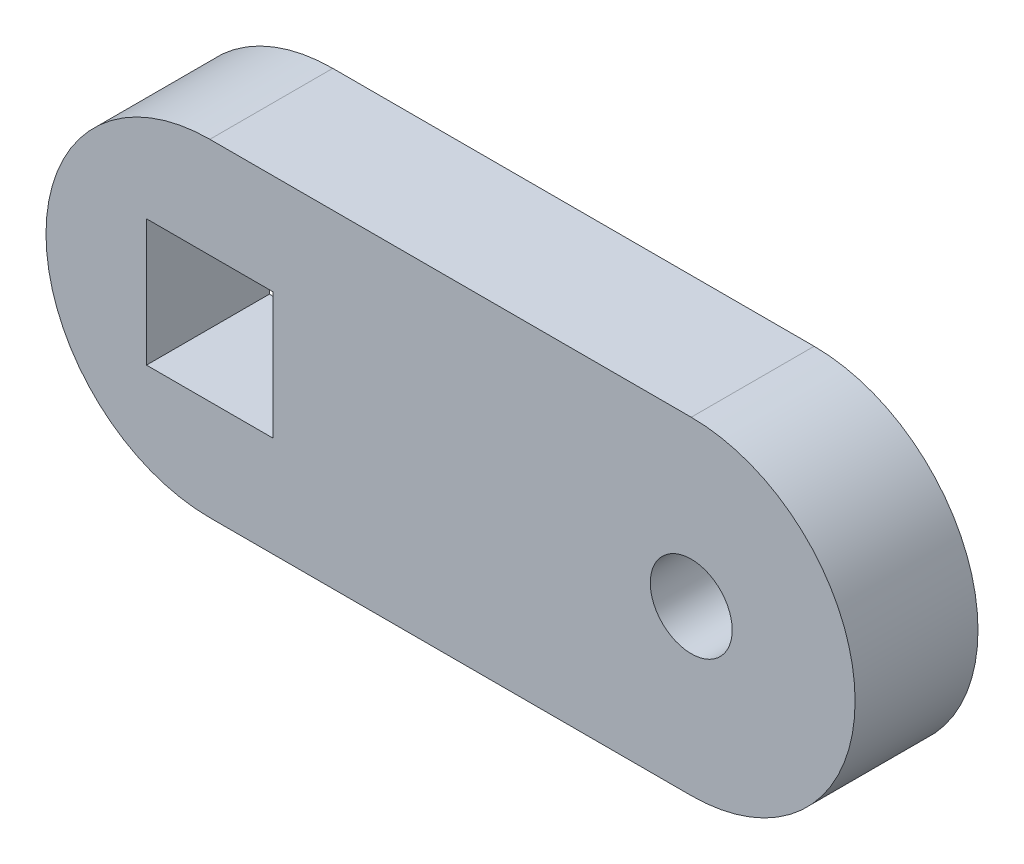
ISO-10303-21;
HEADER;
FILE_DESCRIPTION(('STEP AP214'),'2;1');
FILE_NAME('part.step','',(''),(''),'','','');
FILE_SCHEMA(('AUTOMOTIVE_DESIGN { 1 0 10303 214 1 1 1 1 }'));
ENDSEC;
DATA;
#1=APPLICATION_CONTEXT('core data for automotive mechanical design processes');
#2=APPLICATION_PROTOCOL_DEFINITION('international standard','automotive_design',2000,#1);
#3=PRODUCT_CONTEXT('',#1,'mechanical');
#4=PRODUCT('Part','Part','',(#3));
#5=PRODUCT_RELATED_PRODUCT_CATEGORY('part','',(#4));
#6=PRODUCT_DEFINITION_FORMATION('','',#4);
#7=PRODUCT_DEFINITION_CONTEXT('part definition',#1,'design');
#8=PRODUCT_DEFINITION('design','',#6,#7);
#9=PRODUCT_DEFINITION_SHAPE('','',#8);
#10=(LENGTH_UNIT() NAMED_UNIT(*) SI_UNIT(.MILLI.,.METRE.));
#11=(NAMED_UNIT(*) PLANE_ANGLE_UNIT() SI_UNIT($,.RADIAN.));
#12=(NAMED_UNIT(*) SI_UNIT($,.STERADIAN.) SOLID_ANGLE_UNIT());
#13=UNCERTAINTY_MEASURE_WITH_UNIT(LENGTH_MEASURE(1.E-05),#10,'distance_accuracy_value','');
#14=(GEOMETRIC_REPRESENTATION_CONTEXT(3) GLOBAL_UNCERTAINTY_ASSIGNED_CONTEXT((#13)) GLOBAL_UNIT_ASSIGNED_CONTEXT((#10,
#11,#12)) REPRESENTATION_CONTEXT('',''));
#15=CARTESIAN_POINT('',(0.,0.,0.));
#16=DIRECTION('',(0.,0.,1.));
#17=DIRECTION('',(1.,0.,0.));
#18=AXIS2_PLACEMENT_3D('',#15,#16,#17);
#19=CARTESIAN_POINT('',(50.0261953364315,13.7685928373175,6.));
#20=DIRECTION('',(0.,0.,1.));
#21=DIRECTION('',(1.,0.,0.));
#22=AXIS2_PLACEMENT_3D('',#19,#20,#21);
#23=PLANE('',#22);
#24=DIRECTION('',(0.,1.,0.));
#25=VECTOR('',#24,1.);
#26=CARTESIAN_POINT('',(29.6199453364315,10.6748428373166,6.));
#27=LINE('',#26,#25);
#28=CARTESIAN_POINT('',(29.6199453364315,10.6748428373166,6.));
#29=VERTEX_POINT('',#28);
#30=CARTESIAN_POINT('',(29.6199453364315,16.8623428373166,6.));
#31=VERTEX_POINT('',#30);
#32=EDGE_CURVE('E157',#29,#31,#27,.T.);
#33=ORIENTED_EDGE('',*,*,#32,.F.);
#34=DIRECTION('',(1.,0.,0.));
#35=VECTOR('',#34,1.);
#36=CARTESIAN_POINT('',(23.4324453364315,10.6748428373166,6.));
#37=LINE('',#36,#35);
#38=CARTESIAN_POINT('',(23.4324453364315,10.6748428373166,6.));
#39=VERTEX_POINT('',#38);
#40=EDGE_CURVE('E148',#39,#29,#37,.T.);
#41=ORIENTED_EDGE('',*,*,#40,.F.);
#42=DIRECTION('',(0.,-1.,0.));
#43=VECTOR('',#42,1.);
#44=CARTESIAN_POINT('',(23.4324453364315,16.8623428373166,6.));
#45=LINE('',#44,#43);
#46=CARTESIAN_POINT('',(23.4324453364315,16.8623428373166,6.));
#47=VERTEX_POINT('',#46);
#48=EDGE_CURVE('E175',#47,#39,#45,.T.);
#49=ORIENTED_EDGE('',*,*,#48,.F.);
#50=DIRECTION('',(-1.,0.,0.));
#51=VECTOR('',#50,1.);
#52=CARTESIAN_POINT('',(29.6199453364315,16.8623428373166,6.));
#53=LINE('',#52,#51);
#54=EDGE_CURVE('E171',#31,#47,#53,.T.);
#55=ORIENTED_EDGE('',*,*,#54,.F.);
#56=EDGE_LOOP('',(#33,#41,#49,#55));
#57=FACE_BOUND('',#56,.T.);
#58=DIRECTION('',(1.,0.,0.));
#59=VECTOR('',#58,1.);
#60=CARTESIAN_POINT('',(26.5261953364315,21.7685928373175,6.));
#61=LINE('',#60,#59);
#62=CARTESIAN_POINT('',(26.5261953364315,21.7685928373175,6.));
#63=VERTEX_POINT('',#62);
#64=CARTESIAN_POINT('',(50.0261953364315,21.7685928373175,6.));
#65=VERTEX_POINT('',#64);
#66=EDGE_CURVE('E199',#63,#65,#61,.T.);
#67=ORIENTED_EDGE('',*,*,#66,.F.);
#68=CARTESIAN_POINT('',(26.5261953364287,13.7685928373178,6.));
#69=DIRECTION('',(0.,0.,1.));
#70=DIRECTION('',(1.,0.,0.));
#71=AXIS2_PLACEMENT_3D('',#68,#69,#70);
#72=CIRCLE('',#71,7.99999999999977);
#73=CARTESIAN_POINT('',(26.526195336426,5.76859283731799,6.));
#74=VERTEX_POINT('',#73);
#75=EDGE_CURVE('E210',#63,#74,#72,.T.);
#76=ORIENTED_EDGE('',*,*,#75,.T.);
#77=DIRECTION('',(1.,0.,0.));
#78=VECTOR('',#77,1.);
#79=CARTESIAN_POINT('',(26.526195336426,5.76859283731799,6.));
#80=LINE('',#79,#78);
#81=CARTESIAN_POINT('',(50.0261953364387,5.76859283731753,6.));
#82=VERTEX_POINT('',#81);
#83=EDGE_CURVE('E207',#74,#82,#80,.T.);
#84=ORIENTED_EDGE('',*,*,#83,.T.);
#85=CARTESIAN_POINT('',(50.0261953364315,13.7685928373175,6.));
#86=DIRECTION('',(0.,0.,1.));
#87=DIRECTION('',(1.,0.,0.));
#88=AXIS2_PLACEMENT_3D('',#85,#86,#87);
#89=CIRCLE('',#88,8.);
#90=EDGE_CURVE('E203',#82,#65,#89,.T.);
#91=ORIENTED_EDGE('',*,*,#90,.T.);
#92=EDGE_LOOP('',(#67,#76,#84,#91));
#93=FACE_BOUND('',#92,.T.);
#94=CARTESIAN_POINT('',(50.0261953364315,13.7685928373175,6.));
#95=DIRECTION('',(0.,0.,1.));
#96=DIRECTION('',(1.,0.,0.));
#97=AXIS2_PLACEMENT_3D('',#94,#95,#96);
#98=CIRCLE('',#97,2.);
#99=CARTESIAN_POINT('',(52.0261953364315,13.7685928373175,6.));
#100=VERTEX_POINT('',#99);
#101=EDGE_CURVE('E183',#100,#100,#98,.T.);
#102=ORIENTED_EDGE('',*,*,#101,.F.);
#103=EDGE_LOOP('',(#102));
#104=FACE_BOUND('',#103,.T.);
#105=ADVANCED_FACE('F81',(#57,#93,#104),#23,.T.);
#106=CARTESIAN_POINT('',(50.0261953364315,13.7685928373175,0.));
#107=DIRECTION('',(0.,0.,1.));
#108=DIRECTION('',(1.,0.,0.));
#109=AXIS2_PLACEMENT_3D('',#106,#107,#108);
#110=PLANE('',#109);
#111=DIRECTION('',(1.,0.,0.));
#112=VECTOR('',#111,1.);
#113=CARTESIAN_POINT('',(26.5261953364315,21.7685928373175,0.));
#114=LINE('',#113,#112);
#115=CARTESIAN_POINT('',(26.5261953364315,21.7685928373175,0.));
#116=VERTEX_POINT('',#115);
#117=CARTESIAN_POINT('',(50.0261953364315,21.7685928373175,0.));
#118=VERTEX_POINT('',#117);
#119=EDGE_CURVE('E166',#116,#118,#114,.T.);
#120=ORIENTED_EDGE('',*,*,#119,.T.);
#121=CARTESIAN_POINT('',(50.0261953364315,13.7685928373175,0.));
#122=DIRECTION('',(0.,0.,1.));
#123=DIRECTION('',(1.,0.,0.));
#124=AXIS2_PLACEMENT_3D('',#121,#122,#123);
#125=CIRCLE('',#124,8.);
#126=CARTESIAN_POINT('',(50.0261953364387,5.76859283731753,0.));
#127=VERTEX_POINT('',#126);
#128=EDGE_CURVE('E216',#127,#118,#125,.T.);
#129=ORIENTED_EDGE('',*,*,#128,.F.);
#130=DIRECTION('',(1.,0.,0.));
#131=VECTOR('',#130,1.);
#132=CARTESIAN_POINT('',(26.526195336426,5.76859283731799,0.));
#133=LINE('',#132,#131);
#134=CARTESIAN_POINT('',(26.526195336426,5.76859283731799,0.));
#135=VERTEX_POINT('',#134);
#136=EDGE_CURVE('E220',#135,#127,#133,.T.);
#137=ORIENTED_EDGE('',*,*,#136,.F.);
#138=CARTESIAN_POINT('',(26.5261953364287,13.7685928373178,0.));
#139=DIRECTION('',(0.,0.,1.));
#140=DIRECTION('',(1.,0.,0.));
#141=AXIS2_PLACEMENT_3D('',#138,#139,#140);
#142=CIRCLE('',#141,7.99999999999977);
#143=EDGE_CURVE('E204',#116,#135,#142,.T.);
#144=ORIENTED_EDGE('',*,*,#143,.F.);
#145=EDGE_LOOP('',(#120,#129,#137,#144));
#146=FACE_BOUND('',#145,.T.);
#147=DIRECTION('',(1.,0.,0.));
#148=VECTOR('',#147,1.);
#149=CARTESIAN_POINT('',(23.4324453364315,10.6748428373166,0.));
#150=LINE('',#149,#148);
#151=CARTESIAN_POINT('',(23.4324453364315,10.6748428373166,0.));
#152=VERTEX_POINT('',#151);
#153=CARTESIAN_POINT('',(29.6199453364315,10.6748428373166,0.));
#154=VERTEX_POINT('',#153);
#155=EDGE_CURVE('E107',#152,#154,#150,.T.);
#156=ORIENTED_EDGE('',*,*,#155,.T.);
#157=DIRECTION('',(0.,1.,0.));
#158=VECTOR('',#157,1.);
#159=CARTESIAN_POINT('',(29.6199453364315,13.7685928373166,0.));
#160=LINE('',#159,#158);
#161=CARTESIAN_POINT('',(29.6199453364315,16.8623428373166,0.));
#162=VERTEX_POINT('',#161);
#163=EDGE_CURVE('E164',#154,#162,#160,.T.);
#164=ORIENTED_EDGE('',*,*,#163,.T.);
#165=DIRECTION('',(-1.,0.,0.));
#166=VECTOR('',#165,1.);
#167=CARTESIAN_POINT('',(29.6199453364315,16.8623428373166,0.));
#168=LINE('',#167,#166);
#169=CARTESIAN_POINT('',(23.4324453364315,16.8623428373166,0.));
#170=VERTEX_POINT('',#169);
#171=EDGE_CURVE('E186',#162,#170,#168,.T.);
#172=ORIENTED_EDGE('',*,*,#171,.T.);
#173=DIRECTION('',(0.,-1.,0.));
#174=VECTOR('',#173,1.);
#175=CARTESIAN_POINT('',(23.4324453364315,16.8623428373166,0.));
#176=LINE('',#175,#174);
#177=EDGE_CURVE('E158',#170,#152,#176,.T.);
#178=ORIENTED_EDGE('',*,*,#177,.T.);
#179=EDGE_LOOP('',(#156,#164,#172,#178));
#180=FACE_BOUND('',#179,.T.);
#181=CARTESIAN_POINT('',(50.0261953364315,13.7685928373175,0.));
#182=DIRECTION('',(0.,0.,1.));
#183=DIRECTION('',(1.,0.,0.));
#184=AXIS2_PLACEMENT_3D('',#181,#182,#183);
#185=CIRCLE('',#184,2.);
#186=CARTESIAN_POINT('',(52.0261953364315,13.7685928373175,0.));
#187=VERTEX_POINT('',#186);
#188=EDGE_CURVE('E259',#187,#187,#185,.T.);
#189=ORIENTED_EDGE('',*,*,#188,.T.);
#190=EDGE_LOOP('',(#189));
#191=FACE_BOUND('',#190,.T.);
#192=ADVANCED_FACE('F243',(#146,#180,#191),#110,.F.);
#193=CARTESIAN_POINT('',(26.5261953364315,21.7685928373175,6.));
#194=DIRECTION('',(0.,1.,0.));
#195=DIRECTION('',(0.,0.,1.));
#196=AXIS2_PLACEMENT_3D('',#193,#194,#195);
#197=PLANE('',#196);
#198=ORIENTED_EDGE('',*,*,#119,.F.);
#199=DIRECTION('',(0.,0.,-1.));
#200=VECTOR('',#199,1.);
#201=CARTESIAN_POINT('',(26.5261953364315,21.7685928373175,6.));
#202=LINE('',#201,#200);
#203=EDGE_CURVE('E12',#63,#116,#202,.T.);
#204=ORIENTED_EDGE('',*,*,#203,.F.);
#205=ORIENTED_EDGE('',*,*,#66,.T.);
#206=DIRECTION('',(0.,0.,-1.));
#207=VECTOR('',#206,1.);
#208=CARTESIAN_POINT('',(50.0261953364315,21.7685928373175,6.));
#209=LINE('',#208,#207);
#210=EDGE_CURVE('E85',#65,#118,#209,.T.);
#211=ORIENTED_EDGE('',*,*,#210,.T.);
#212=EDGE_LOOP('',(#198,#204,#205,#211));
#213=FACE_BOUND('',#212,.T.);
#214=ADVANCED_FACE('F83',(#213),#197,.T.);
#215=CARTESIAN_POINT('',(26.5261953364287,13.7685928373178,6.));
#216=DIRECTION('',(0.,0.,-1.));
#217=DIRECTION('',(-1.,0.,0.));
#218=AXIS2_PLACEMENT_3D('',#215,#216,#217);
#219=CYLINDRICAL_SURFACE('',#218,7.99999999999977);
#220=ORIENTED_EDGE('',*,*,#143,.T.);
#221=DIRECTION('',(0.,0.,-1.));
#222=VECTOR('',#221,1.);
#223=CARTESIAN_POINT('',(26.526195336426,5.76859283731799,6.));
#224=LINE('',#223,#222);
#225=EDGE_CURVE('E91',#74,#135,#224,.T.);
#226=ORIENTED_EDGE('',*,*,#225,.F.);
#227=ORIENTED_EDGE('',*,*,#75,.F.);
#228=ORIENTED_EDGE('',*,*,#203,.T.);
#229=EDGE_LOOP('',(#220,#226,#227,#228));
#230=FACE_BOUND('',#229,.T.);
#231=ADVANCED_FACE('F247',(#230),#219,.T.);
#232=CARTESIAN_POINT('',(26.526195336426,5.76859283731799,6.));
#233=DIRECTION('',(0.,1.,0.));
#234=DIRECTION('',(-1.,0.,0.));
#235=AXIS2_PLACEMENT_3D('',#232,#233,#234);
#236=PLANE('',#235);
#237=ORIENTED_EDGE('',*,*,#136,.T.);
#238=DIRECTION('',(0.,0.,-1.));
#239=VECTOR('',#238,1.);
#240=CARTESIAN_POINT('',(50.0261953364387,5.76859283731753,6.));
#241=LINE('',#240,#239);
#242=EDGE_CURVE('E227',#82,#127,#241,.T.);
#243=ORIENTED_EDGE('',*,*,#242,.F.);
#244=ORIENTED_EDGE('',*,*,#83,.F.);
#245=ORIENTED_EDGE('',*,*,#225,.T.);
#246=EDGE_LOOP('',(#237,#243,#244,#245));
#247=FACE_BOUND('',#246,.T.);
#248=ADVANCED_FACE('F251',(#247),#236,.F.);
#249=CARTESIAN_POINT('',(50.0261953364315,13.7685928373175,6.));
#250=DIRECTION('',(0.,0.,-1.));
#251=DIRECTION('',(-1.,0.,0.));
#252=AXIS2_PLACEMENT_3D('',#249,#250,#251);
#253=CYLINDRICAL_SURFACE('',#252,8.);
#254=ORIENTED_EDGE('',*,*,#128,.T.);
#255=ORIENTED_EDGE('',*,*,#210,.F.);
#256=ORIENTED_EDGE('',*,*,#90,.F.);
#257=ORIENTED_EDGE('',*,*,#242,.T.);
#258=EDGE_LOOP('',(#254,#255,#256,#257));
#259=FACE_BOUND('',#258,.T.);
#260=ADVANCED_FACE('F239',(#259),#253,.T.);
#261=CARTESIAN_POINT('',(23.4324453364315,10.6748428373166,6.));
#262=DIRECTION('',(0.,1.,0.));
#263=DIRECTION('',(0.,0.,1.));
#264=AXIS2_PLACEMENT_3D('',#261,#262,#263);
#265=PLANE('',#264);
#266=ORIENTED_EDGE('',*,*,#155,.F.);
#267=DIRECTION('',(0.,0.,-1.));
#268=VECTOR('',#267,1.);
#269=CARTESIAN_POINT('',(23.4324453364315,10.6748428373166,6.));
#270=LINE('',#269,#268);
#271=EDGE_CURVE('E152',#39,#152,#270,.T.);
#272=ORIENTED_EDGE('',*,*,#271,.F.);
#273=ORIENTED_EDGE('',*,*,#40,.T.);
#274=DIRECTION('',(0.,0.,-1.));
#275=VECTOR('',#274,1.);
#276=CARTESIAN_POINT('',(29.6199453364315,10.6748428373166,6.));
#277=LINE('',#276,#275);
#278=EDGE_CURVE('E151',#29,#154,#277,.T.);
#279=ORIENTED_EDGE('',*,*,#278,.T.);
#280=EDGE_LOOP('',(#266,#272,#273,#279));
#281=FACE_BOUND('',#280,.T.);
#282=ADVANCED_FACE('F150',(#281),#265,.T.);
#283=CARTESIAN_POINT('',(29.6199453364315,13.7685928373166,6.));
#284=DIRECTION('',(-1.,0.,0.));
#285=DIRECTION('',(0.,0.,1.));
#286=AXIS2_PLACEMENT_3D('',#283,#284,#285);
#287=PLANE('',#286);
#288=ORIENTED_EDGE('',*,*,#163,.F.);
#289=ORIENTED_EDGE('',*,*,#278,.F.);
#290=ORIENTED_EDGE('',*,*,#32,.T.);
#291=DIRECTION('',(0.,0.,-1.));
#292=VECTOR('',#291,1.);
#293=CARTESIAN_POINT('',(29.6199453364315,16.8623428373166,6.));
#294=LINE('',#293,#292);
#295=EDGE_CURVE('E167',#31,#162,#294,.T.);
#296=ORIENTED_EDGE('',*,*,#295,.T.);
#297=EDGE_LOOP('',(#288,#289,#290,#296));
#298=FACE_BOUND('',#297,.T.);
#299=ADVANCED_FACE('F161',(#298),#287,.T.);
#300=CARTESIAN_POINT('',(29.6199453364315,16.8623428373166,6.));
#301=DIRECTION('',(0.,-1.,0.));
#302=DIRECTION('',(0.,0.,-1.));
#303=AXIS2_PLACEMENT_3D('',#300,#301,#302);
#304=PLANE('',#303);
#305=ORIENTED_EDGE('',*,*,#171,.F.);
#306=ORIENTED_EDGE('',*,*,#295,.F.);
#307=ORIENTED_EDGE('',*,*,#54,.T.);
#308=DIRECTION('',(0.,0.,-1.));
#309=VECTOR('',#308,1.);
#310=CARTESIAN_POINT('',(23.4324453364315,16.8623428373166,6.));
#311=LINE('',#310,#309);
#312=EDGE_CURVE('E99',#47,#170,#311,.T.);
#313=ORIENTED_EDGE('',*,*,#312,.T.);
#314=EDGE_LOOP('',(#305,#306,#307,#313));
#315=FACE_BOUND('',#314,.T.);
#316=ADVANCED_FACE('F273',(#315),#304,.T.);
#317=CARTESIAN_POINT('',(23.4324453364315,16.8623428373166,6.));
#318=DIRECTION('',(1.,0.,0.));
#319=DIRECTION('',(0.,0.,-1.));
#320=AXIS2_PLACEMENT_3D('',#317,#318,#319);
#321=PLANE('',#320);
#322=ORIENTED_EDGE('',*,*,#177,.F.);
#323=ORIENTED_EDGE('',*,*,#312,.F.);
#324=ORIENTED_EDGE('',*,*,#48,.T.);
#325=ORIENTED_EDGE('',*,*,#271,.T.);
#326=EDGE_LOOP('',(#322,#323,#324,#325));
#327=FACE_BOUND('',#326,.T.);
#328=ADVANCED_FACE('F268',(#327),#321,.T.);
#329=CARTESIAN_POINT('',(50.0261953364315,13.7685928373175,6.));
#330=DIRECTION('',(0.,0.,-1.));
#331=DIRECTION('',(-1.,0.,0.));
#332=AXIS2_PLACEMENT_3D('',#329,#330,#331);
#333=CYLINDRICAL_SURFACE('',#332,2.);
#334=ORIENTED_EDGE('',*,*,#101,.T.);
#335=EDGE_LOOP('',(#334));
#336=FACE_BOUND('',#335,.T.);
#337=ORIENTED_EDGE('',*,*,#188,.F.);
#338=EDGE_LOOP('',(#337));
#339=FACE_BOUND('',#338,.T.);
#340=ADVANCED_FACE('F266',(#336,#339),#333,.F.);
#341=CLOSED_SHELL('',(#105,#192,#214,#231,#248,#260,#282,#299,#316,#328,#340));
#342=MANIFOLD_SOLID_BREP('B2',#341);
#343=ADVANCED_BREP_SHAPE_REPRESENTATION('',(#18,#342),#14);
#344=SHAPE_DEFINITION_REPRESENTATION(#9,#343);
ENDSEC;
END-ISO-10303-21;
